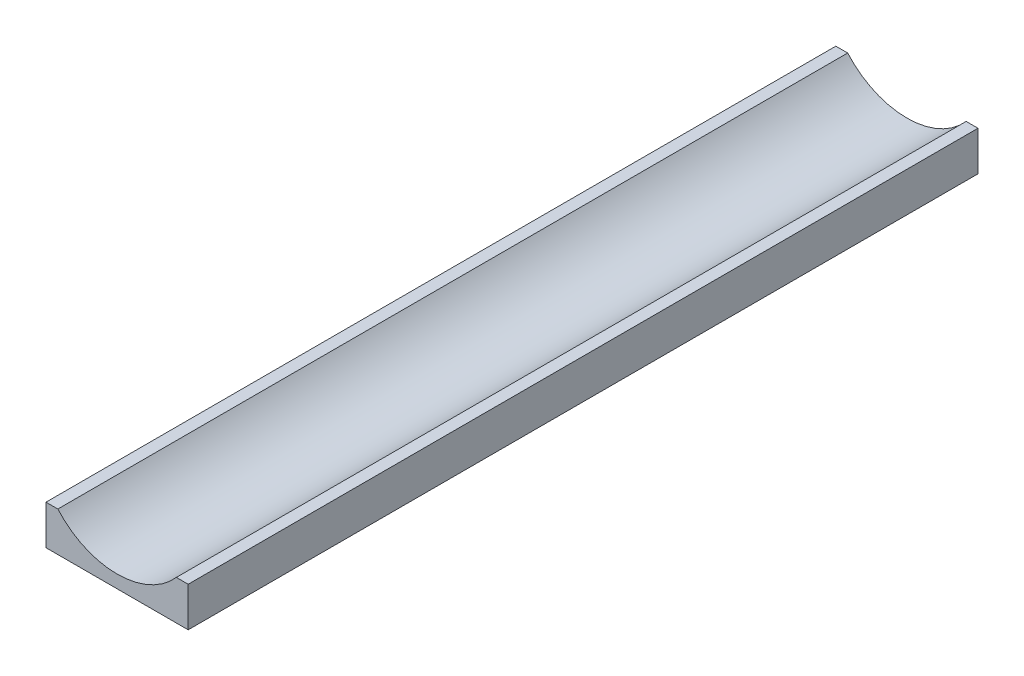
ISO-10303-21;
HEADER;
FILE_DESCRIPTION(('STEP AP214'),'2;1');
FILE_NAME('part.step','',(''),(''),'','','');
FILE_SCHEMA(('AUTOMOTIVE_DESIGN { 1 0 10303 214 1 1 1 1 }'));
ENDSEC;
DATA;
#1=APPLICATION_CONTEXT('core data for automotive mechanical design processes');
#2=APPLICATION_PROTOCOL_DEFINITION('international standard','automotive_design',2000,#1);
#3=PRODUCT_CONTEXT('',#1,'mechanical');
#4=PRODUCT('Part','Part','',(#3));
#5=PRODUCT_RELATED_PRODUCT_CATEGORY('part','',(#4));
#6=PRODUCT_DEFINITION_FORMATION('','',#4);
#7=PRODUCT_DEFINITION_CONTEXT('part definition',#1,'design');
#8=PRODUCT_DEFINITION('design','',#6,#7);
#9=PRODUCT_DEFINITION_SHAPE('','',#8);
#10=(LENGTH_UNIT() NAMED_UNIT(*) SI_UNIT(.MILLI.,.METRE.));
#11=(NAMED_UNIT(*) PLANE_ANGLE_UNIT() SI_UNIT($,.RADIAN.));
#12=(NAMED_UNIT(*) SI_UNIT($,.STERADIAN.) SOLID_ANGLE_UNIT());
#13=UNCERTAINTY_MEASURE_WITH_UNIT(LENGTH_MEASURE(1.E-05),#10,'distance_accuracy_value','');
#14=(GEOMETRIC_REPRESENTATION_CONTEXT(3) GLOBAL_UNCERTAINTY_ASSIGNED_CONTEXT((#13)) GLOBAL_UNIT_ASSIGNED_CONTEXT((#10,
#11,#12)) REPRESENTATION_CONTEXT('',''));
#15=CARTESIAN_POINT('',(0.,0.,0.));
#16=DIRECTION('',(0.,0.,1.));
#17=DIRECTION('',(1.,0.,0.));
#18=AXIS2_PLACEMENT_3D('',#15,#16,#17);
#19=CARTESIAN_POINT('',(0.,6.5,0.));
#20=DIRECTION('',(0.,-1.,0.));
#21=DIRECTION('',(0.,0.,-1.));
#22=AXIS2_PLACEMENT_3D('',#19,#20,#21);
#23=PLANE('',#22);
#24=DIRECTION('',(-1.,0.,0.));
#25=VECTOR('',#24,1.);
#26=CARTESIAN_POINT('',(-9.7,6.5,3.2));
#27=LINE('',#26,#25);
#28=CARTESIAN_POINT('',(9.7,6.5,3.2));
#29=VERTEX_POINT('',#28);
#30=CARTESIAN_POINT('',(-9.7,6.5,3.2));
#31=VERTEX_POINT('',#30);
#32=EDGE_CURVE('E58',#29,#31,#27,.T.);
#33=ORIENTED_EDGE('',*,*,#32,.F.);
#34=DIRECTION('',(0.,0.,1.));
#35=VECTOR('',#34,1.);
#36=CARTESIAN_POINT('',(9.7,6.5,3.2));
#37=LINE('',#36,#35);
#38=CARTESIAN_POINT('',(9.7,6.5,-3.2));
#39=VERTEX_POINT('',#38);
#40=EDGE_CURVE('E164',#39,#29,#37,.T.);
#41=ORIENTED_EDGE('',*,*,#40,.F.);
#42=DIRECTION('',(1.,0.,0.));
#43=VECTOR('',#42,1.);
#44=CARTESIAN_POINT('',(-9.7,6.5,-3.2));
#45=LINE('',#44,#43);
#46=CARTESIAN_POINT('',(-9.7,6.5,-3.2));
#47=VERTEX_POINT('',#46);
#48=EDGE_CURVE('E167',#47,#39,#45,.T.);
#49=ORIENTED_EDGE('',*,*,#48,.F.);
#50=DIRECTION('',(0.,0.,-1.));
#51=VECTOR('',#50,1.);
#52=CARTESIAN_POINT('',(-9.7,6.5,3.2));
#53=LINE('',#52,#51);
#54=EDGE_CURVE('E173',#31,#47,#53,.T.);
#55=ORIENTED_EDGE('',*,*,#54,.F.);
#56=EDGE_LOOP('',(#33,#41,#49,#55));
#57=FACE_BOUND('',#56,.T.);
#58=DIRECTION('',(0.,0.,1.));
#59=VECTOR('',#58,1.);
#60=CARTESIAN_POINT('',(3.2,6.5,-89.3));
#61=LINE('',#60,#59);
#62=CARTESIAN_POINT('',(3.2,6.5,-95.7));
#63=VERTEX_POINT('',#62);
#64=CARTESIAN_POINT('',(3.2,6.5,-89.3));
#65=VERTEX_POINT('',#64);
#66=EDGE_CURVE('E66',#63,#65,#61,.T.);
#67=ORIENTED_EDGE('',*,*,#66,.F.);
#68=DIRECTION('',(1.,0.,0.));
#69=VECTOR('',#68,1.);
#70=CARTESIAN_POINT('',(3.2,6.5,-95.7));
#71=LINE('',#70,#69);
#72=CARTESIAN_POINT('',(-3.2,6.5,-95.7));
#73=VERTEX_POINT('',#72);
#74=EDGE_CURVE('E192',#73,#63,#71,.T.);
#75=ORIENTED_EDGE('',*,*,#74,.F.);
#76=DIRECTION('',(0.,0.,-1.));
#77=VECTOR('',#76,1.);
#78=CARTESIAN_POINT('',(-3.2,6.5,-89.3));
#79=LINE('',#78,#77);
#80=CARTESIAN_POINT('',(-3.2,6.5,-89.3));
#81=VERTEX_POINT('',#80);
#82=EDGE_CURVE('E195',#81,#73,#79,.T.);
#83=ORIENTED_EDGE('',*,*,#82,.F.);
#84=DIRECTION('',(-1.,0.,0.));
#85=VECTOR('',#84,1.);
#86=CARTESIAN_POINT('',(3.2,6.5,-89.3));
#87=LINE('',#86,#85);
#88=EDGE_CURVE('E199',#65,#81,#87,.T.);
#89=ORIENTED_EDGE('',*,*,#88,.F.);
#90=EDGE_LOOP('',(#67,#75,#83,#89));
#91=FACE_BOUND('',#90,.T.);
#92=DIRECTION('',(0.,0.,-1.));
#93=VECTOR('',#92,1.);
#94=CARTESIAN_POINT('',(-18.,6.5,92.5));
#95=LINE('',#94,#93);
#96=CARTESIAN_POINT('',(-18.,6.5,100.));
#97=VERTEX_POINT('',#96);
#98=CARTESIAN_POINT('',(-18.,6.5,-100.));
#99=VERTEX_POINT('',#98);
#100=EDGE_CURVE('E221',#97,#99,#95,.T.);
#101=ORIENTED_EDGE('',*,*,#100,.T.);
#102=DIRECTION('',(-1.,0.,0.));
#103=VECTOR('',#102,1.);
#104=CARTESIAN_POINT('',(18.,6.5,-100.));
#105=LINE('',#104,#103);
#106=CARTESIAN_POINT('',(18.,6.5,-100.));
#107=VERTEX_POINT('',#106);
#108=EDGE_CURVE('E236',#107,#99,#105,.T.);
#109=ORIENTED_EDGE('',*,*,#108,.F.);
#110=DIRECTION('',(0.,0.,-1.));
#111=VECTOR('',#110,1.);
#112=CARTESIAN_POINT('',(18.,6.5,92.5));
#113=LINE('',#112,#111);
#114=CARTESIAN_POINT('',(18.,6.5,100.));
#115=VERTEX_POINT('',#114);
#116=EDGE_CURVE('E219',#115,#107,#113,.T.);
#117=ORIENTED_EDGE('',*,*,#116,.F.);
#118=DIRECTION('',(1.,0.,0.));
#119=VECTOR('',#118,1.);
#120=CARTESIAN_POINT('',(-18.,6.5,100.));
#121=LINE('',#120,#119);
#122=EDGE_CURVE('E51',#97,#115,#121,.T.);
#123=ORIENTED_EDGE('',*,*,#122,.F.);
#124=EDGE_LOOP('',(#101,#109,#117,#123));
#125=FACE_BOUND('',#124,.T.);
#126=ADVANCED_FACE('F44',(#57,#91,#125),#23,.T.);
#127=CARTESIAN_POINT('',(15.,16.5,0.));
#128=DIRECTION('',(0.,1.,0.));
#129=DIRECTION('',(0.,0.,-1.));
#130=AXIS2_PLACEMENT_3D('',#127,#128,#129);
#131=PLANE('',#130);
#132=DIRECTION('',(0.,0.,-1.));
#133=VECTOR('',#132,1.);
#134=CARTESIAN_POINT('',(15.,16.5,0.));
#135=LINE('',#134,#133);
#136=CARTESIAN_POINT('',(15.,16.5,100.));
#137=VERTEX_POINT('',#136);
#138=CARTESIAN_POINT('',(15.,16.5,-100.));
#139=VERTEX_POINT('',#138);
#140=EDGE_CURVE('E179',#137,#139,#135,.T.);
#141=ORIENTED_EDGE('',*,*,#140,.F.);
#142=DIRECTION('',(-1.,0.,0.));
#143=VECTOR('',#142,1.);
#144=CARTESIAN_POINT('',(18.,16.5,100.));
#145=LINE('',#144,#143);
#146=CARTESIAN_POINT('',(18.,16.5,100.));
#147=VERTEX_POINT('',#146);
#148=EDGE_CURVE('E248',#147,#137,#145,.T.);
#149=ORIENTED_EDGE('',*,*,#148,.F.);
#150=DIRECTION('',(0.,0.,1.));
#151=VECTOR('',#150,1.);
#152=CARTESIAN_POINT('',(18.,16.5,0.));
#153=LINE('',#152,#151);
#154=CARTESIAN_POINT('',(18.,16.5,-100.));
#155=VERTEX_POINT('',#154);
#156=EDGE_CURVE('E213',#147,#155,#153,.F.);
#157=ORIENTED_EDGE('',*,*,#156,.T.);
#158=DIRECTION('',(1.,0.,0.));
#159=VECTOR('',#158,1.);
#160=CARTESIAN_POINT('',(15.,16.5,-100.));
#161=LINE('',#160,#159);
#162=EDGE_CURVE('E223',#139,#155,#161,.T.);
#163=ORIENTED_EDGE('',*,*,#162,.F.);
#164=EDGE_LOOP('',(#141,#149,#157,#163));
#165=FACE_BOUND('',#164,.T.);
#166=ADVANCED_FACE('F267',(#165),#131,.T.);
#167=CARTESIAN_POINT('',(18.,-1.5,0.));
#168=DIRECTION('',(-1.,0.,0.));
#169=DIRECTION('',(0.,0.,1.));
#170=AXIS2_PLACEMENT_3D('',#167,#168,#169);
#171=PLANE('',#170);
#172=ORIENTED_EDGE('',*,*,#156,.F.);
#173=DIRECTION('',(0.,1.,0.));
#174=VECTOR('',#173,1.);
#175=CARTESIAN_POINT('',(18.,6.5,100.));
#176=LINE('',#175,#174);
#177=EDGE_CURVE('E251',#115,#147,#176,.T.);
#178=ORIENTED_EDGE('',*,*,#177,.F.);
#179=ORIENTED_EDGE('',*,*,#116,.T.);
#180=DIRECTION('',(0.,-1.,0.));
#181=VECTOR('',#180,1.);
#182=CARTESIAN_POINT('',(18.,16.5,-100.));
#183=LINE('',#182,#181);
#184=EDGE_CURVE('E239',#155,#107,#183,.T.);
#185=ORIENTED_EDGE('',*,*,#184,.F.);
#186=EDGE_LOOP('',(#172,#178,#179,#185));
#187=FACE_BOUND('',#186,.T.);
#188=ADVANCED_FACE('F262',(#187),#171,.F.);
#189=CARTESIAN_POINT('',(-15.,16.5,0.));
#190=DIRECTION('',(0.,1.,0.));
#191=DIRECTION('',(0.,0.,-1.));
#192=AXIS2_PLACEMENT_3D('',#189,#190,#191);
#193=PLANE('',#192);
#194=DIRECTION('',(0.,0.,1.));
#195=VECTOR('',#194,1.);
#196=CARTESIAN_POINT('',(-18.,16.5,0.));
#197=LINE('',#196,#195);
#198=CARTESIAN_POINT('',(-18.,16.5,100.));
#199=VERTEX_POINT('',#198);
#200=CARTESIAN_POINT('',(-18.,16.5,-100.));
#201=VERTEX_POINT('',#200);
#202=EDGE_CURVE('E215',#199,#201,#197,.F.);
#203=ORIENTED_EDGE('',*,*,#202,.F.);
#204=DIRECTION('',(-1.,0.,0.));
#205=VECTOR('',#204,1.);
#206=CARTESIAN_POINT('',(-15.,16.5,100.));
#207=LINE('',#206,#205);
#208=CARTESIAN_POINT('',(-15.,16.5,100.));
#209=VERTEX_POINT('',#208);
#210=EDGE_CURVE('E242',#209,#199,#207,.T.);
#211=ORIENTED_EDGE('',*,*,#210,.F.);
#212=DIRECTION('',(0.,0.,-1.));
#213=VECTOR('',#212,1.);
#214=CARTESIAN_POINT('',(-15.,16.5,0.));
#215=LINE('',#214,#213);
#216=CARTESIAN_POINT('',(-15.,16.5,-100.));
#217=VERTEX_POINT('',#216);
#218=EDGE_CURVE('E217',#209,#217,#215,.T.);
#219=ORIENTED_EDGE('',*,*,#218,.T.);
#220=DIRECTION('',(1.,0.,0.));
#221=VECTOR('',#220,1.);
#222=CARTESIAN_POINT('',(-18.,16.5,-100.));
#223=LINE('',#222,#221);
#224=EDGE_CURVE('E230',#201,#217,#223,.T.);
#225=ORIENTED_EDGE('',*,*,#224,.F.);
#226=EDGE_LOOP('',(#203,#211,#219,#225));
#227=FACE_BOUND('',#226,.T.);
#228=ADVANCED_FACE('F277',(#227),#193,.T.);
#229=CARTESIAN_POINT('',(-18.,-1.5,0.));
#230=DIRECTION('',(-1.,0.,0.));
#231=DIRECTION('',(0.,0.,1.));
#232=AXIS2_PLACEMENT_3D('',#229,#230,#231);
#233=PLANE('',#232);
#234=ORIENTED_EDGE('',*,*,#100,.F.);
#235=DIRECTION('',(0.,-1.,0.));
#236=VECTOR('',#235,1.);
#237=CARTESIAN_POINT('',(-18.,16.5,100.));
#238=LINE('',#237,#236);
#239=EDGE_CURVE('E11',#199,#97,#238,.T.);
#240=ORIENTED_EDGE('',*,*,#239,.F.);
#241=ORIENTED_EDGE('',*,*,#202,.T.);
#242=DIRECTION('',(0.,1.,0.));
#243=VECTOR('',#242,1.);
#244=CARTESIAN_POINT('',(-18.,6.5,-100.));
#245=LINE('',#244,#243);
#246=EDGE_CURVE('E233',#99,#201,#245,.T.);
#247=ORIENTED_EDGE('',*,*,#246,.F.);
#248=EDGE_LOOP('',(#234,#240,#241,#247));
#249=FACE_BOUND('',#248,.T.);
#250=ADVANCED_FACE('F280',(#249),#233,.T.);
#251=CARTESIAN_POINT('',(0.,29.7287565553229,-92.5));
#252=DIRECTION('',(0.,0.,1.));
#253=DIRECTION('',(1.,0.,0.));
#254=AXIS2_PLACEMENT_3D('',#251,#252,#253);
#255=CYLINDRICAL_SURFACE('',#254,19.9999999999999);
#256=ORIENTED_EDGE('',*,*,#218,.F.);
#257=CARTESIAN_POINT('',(0.,29.7287565553229,100.));
#258=DIRECTION('',(0.,0.,-1.));
#259=DIRECTION('',(1.,0.,0.));
#260=AXIS2_PLACEMENT_3D('',#257,#258,#259);
#261=CIRCLE('',#260,19.9999999999999);
#262=EDGE_CURVE('E245',#137,#209,#261,.T.);
#263=ORIENTED_EDGE('',*,*,#262,.F.);
#264=ORIENTED_EDGE('',*,*,#140,.T.);
#265=CARTESIAN_POINT('',(0.,29.7287565553229,-100.));
#266=DIRECTION('',(0.,0.,1.));
#267=DIRECTION('',(-1.,0.,0.));
#268=AXIS2_PLACEMENT_3D('',#265,#266,#267);
#269=CIRCLE('',#268,19.9999999999999);
#270=EDGE_CURVE('E227',#217,#139,#269,.T.);
#271=ORIENTED_EDGE('',*,*,#270,.F.);
#272=EDGE_LOOP('',(#256,#263,#264,#271));
#273=FACE_BOUND('',#272,.T.);
#274=ADVANCED_FACE('F273',(#273),#255,.F.);
#275=CARTESIAN_POINT('',(0.,29.7287565553229,-100.));
#276=DIRECTION('',(0.,0.,-1.));
#277=DIRECTION('',(-1.,0.,0.));
#278=AXIS2_PLACEMENT_3D('',#275,#276,#277);
#279=PLANE('',#278);
#280=ORIENTED_EDGE('',*,*,#184,.T.);
#281=ORIENTED_EDGE('',*,*,#108,.T.);
#282=ORIENTED_EDGE('',*,*,#246,.T.);
#283=ORIENTED_EDGE('',*,*,#224,.T.);
#284=ORIENTED_EDGE('',*,*,#270,.T.);
#285=ORIENTED_EDGE('',*,*,#162,.T.);
#286=EDGE_LOOP('',(#280,#281,#282,#283,#284,#285));
#287=FACE_BOUND('',#286,.T.);
#288=ADVANCED_FACE('F269',(#287),#279,.T.);
#289=CARTESIAN_POINT('',(0.,29.7287565553229,100.));
#290=DIRECTION('',(0.,0.,1.));
#291=DIRECTION('',(1.,0.,0.));
#292=AXIS2_PLACEMENT_3D('',#289,#290,#291);
#293=PLANE('',#292);
#294=ORIENTED_EDGE('',*,*,#239,.T.);
#295=ORIENTED_EDGE('',*,*,#122,.T.);
#296=ORIENTED_EDGE('',*,*,#177,.T.);
#297=ORIENTED_EDGE('',*,*,#148,.T.);
#298=ORIENTED_EDGE('',*,*,#262,.T.);
#299=ORIENTED_EDGE('',*,*,#210,.T.);
#300=EDGE_LOOP('',(#294,#295,#296,#297,#298,#299));
#301=FACE_BOUND('',#300,.T.);
#302=ADVANCED_FACE('F257',(#301),#293,.T.);
#303=CARTESIAN_POINT('',(3.2,8.5,-89.3));
#304=DIRECTION('',(1.,0.,0.));
#305=DIRECTION('',(0.,0.,-1.));
#306=AXIS2_PLACEMENT_3D('',#303,#304,#305);
#307=PLANE('',#306);
#308=ORIENTED_EDGE('',*,*,#66,.T.);
#309=DIRECTION('',(0.,-1.,0.));
#310=VECTOR('',#309,1.);
#311=CARTESIAN_POINT('',(3.2,8.5,-89.3));
#312=LINE('',#311,#310);
#313=CARTESIAN_POINT('',(3.2,8.5,-89.3));
#314=VERTEX_POINT('',#313);
#315=EDGE_CURVE('E183',#314,#65,#312,.T.);
#316=ORIENTED_EDGE('',*,*,#315,.F.);
#317=DIRECTION('',(0.,0.,1.));
#318=VECTOR('',#317,1.);
#319=CARTESIAN_POINT('',(3.2,8.5,-89.3));
#320=LINE('',#319,#318);
#321=CARTESIAN_POINT('',(3.2,8.5,-95.7));
#322=VERTEX_POINT('',#321);
#323=EDGE_CURVE('E196',#322,#314,#320,.T.);
#324=ORIENTED_EDGE('',*,*,#323,.F.);
#325=DIRECTION('',(0.,-1.,0.));
#326=VECTOR('',#325,1.);
#327=CARTESIAN_POINT('',(3.2,8.5,-95.7));
#328=LINE('',#327,#326);
#329=EDGE_CURVE('E190',#322,#63,#328,.T.);
#330=ORIENTED_EDGE('',*,*,#329,.T.);
#331=EDGE_LOOP('',(#308,#316,#324,#330));
#332=FACE_BOUND('',#331,.T.);
#333=ADVANCED_FACE('F283',(#332),#307,.F.);
#334=CARTESIAN_POINT('',(3.2,8.5,-95.7));
#335=DIRECTION('',(0.,0.,-1.));
#336=DIRECTION('',(-1.,0.,0.));
#337=AXIS2_PLACEMENT_3D('',#334,#335,#336);
#338=PLANE('',#337);
#339=ORIENTED_EDGE('',*,*,#74,.T.);
#340=ORIENTED_EDGE('',*,*,#329,.F.);
#341=DIRECTION('',(1.,0.,0.));
#342=VECTOR('',#341,1.);
#343=CARTESIAN_POINT('',(3.2,8.5,-95.7));
#344=LINE('',#343,#342);
#345=CARTESIAN_POINT('',(-3.2,8.5,-95.7));
#346=VERTEX_POINT('',#345);
#347=EDGE_CURVE('E185',#346,#322,#344,.T.);
#348=ORIENTED_EDGE('',*,*,#347,.F.);
#349=DIRECTION('',(0.,-1.,0.));
#350=VECTOR('',#349,1.);
#351=CARTESIAN_POINT('',(-3.2,8.5,-95.7));
#352=LINE('',#351,#350);
#353=EDGE_CURVE('E188',#346,#73,#352,.T.);
#354=ORIENTED_EDGE('',*,*,#353,.T.);
#355=EDGE_LOOP('',(#339,#340,#348,#354));
#356=FACE_BOUND('',#355,.T.);
#357=ADVANCED_FACE('F292',(#356),#338,.F.);
#358=CARTESIAN_POINT('',(-3.2,8.5,-89.3));
#359=DIRECTION('',(-1.,0.,0.));
#360=DIRECTION('',(0.,0.,1.));
#361=AXIS2_PLACEMENT_3D('',#358,#359,#360);
#362=PLANE('',#361);
#363=ORIENTED_EDGE('',*,*,#82,.T.);
#364=ORIENTED_EDGE('',*,*,#353,.F.);
#365=DIRECTION('',(0.,0.,-1.));
#366=VECTOR('',#365,1.);
#367=CARTESIAN_POINT('',(-3.2,8.5,-89.3));
#368=LINE('',#367,#366);
#369=CARTESIAN_POINT('',(-3.2,8.5,-89.3));
#370=VERTEX_POINT('',#369);
#371=EDGE_CURVE('E205',#370,#346,#368,.T.);
#372=ORIENTED_EDGE('',*,*,#371,.F.);
#373=DIRECTION('',(0.,-1.,0.));
#374=VECTOR('',#373,1.);
#375=CARTESIAN_POINT('',(-3.2,8.5,-89.3));
#376=LINE('',#375,#374);
#377=EDGE_CURVE('E186',#370,#81,#376,.T.);
#378=ORIENTED_EDGE('',*,*,#377,.T.);
#379=EDGE_LOOP('',(#363,#364,#372,#378));
#380=FACE_BOUND('',#379,.T.);
#381=ADVANCED_FACE('F316',(#380),#362,.F.);
#382=CARTESIAN_POINT('',(3.2,8.5,-89.3));
#383=DIRECTION('',(0.,0.,1.));
#384=DIRECTION('',(1.,0.,0.));
#385=AXIS2_PLACEMENT_3D('',#382,#383,#384);
#386=PLANE('',#385);
#387=ORIENTED_EDGE('',*,*,#88,.T.);
#388=ORIENTED_EDGE('',*,*,#377,.F.);
#389=DIRECTION('',(-1.,0.,0.));
#390=VECTOR('',#389,1.);
#391=CARTESIAN_POINT('',(3.2,8.5,-89.3));
#392=LINE('',#391,#390);
#393=EDGE_CURVE('E208',#314,#370,#392,.T.);
#394=ORIENTED_EDGE('',*,*,#393,.F.);
#395=ORIENTED_EDGE('',*,*,#315,.T.);
#396=EDGE_LOOP('',(#387,#388,#394,#395));
#397=FACE_BOUND('',#396,.T.);
#398=ADVANCED_FACE('F312',(#397),#386,.F.);
#399=CARTESIAN_POINT('',(0.,8.5,0.));
#400=DIRECTION('',(0.,1.,0.));
#401=DIRECTION('',(0.,0.,1.));
#402=AXIS2_PLACEMENT_3D('',#399,#400,#401);
#403=PLANE('',#402);
#404=ORIENTED_EDGE('',*,*,#323,.T.);
#405=ORIENTED_EDGE('',*,*,#393,.T.);
#406=ORIENTED_EDGE('',*,*,#371,.T.);
#407=ORIENTED_EDGE('',*,*,#347,.T.);
#408=EDGE_LOOP('',(#404,#405,#406,#407));
#409=FACE_BOUND('',#408,.T.);
#410=ADVANCED_FACE('F309',(#409),#403,.F.);
#411=CARTESIAN_POINT('',(-9.7,8.5,3.2));
#412=DIRECTION('',(0.,0.,1.));
#413=DIRECTION('',(1.,0.,0.));
#414=AXIS2_PLACEMENT_3D('',#411,#412,#413);
#415=PLANE('',#414);
#416=ORIENTED_EDGE('',*,*,#32,.T.);
#417=DIRECTION('',(0.,-1.,0.));
#418=VECTOR('',#417,1.);
#419=CARTESIAN_POINT('',(-9.7,8.5,3.2));
#420=LINE('',#419,#418);
#421=CARTESIAN_POINT('',(-9.7,8.5,3.2));
#422=VERTEX_POINT('',#421);
#423=EDGE_CURVE('E142',#422,#31,#420,.T.);
#424=ORIENTED_EDGE('',*,*,#423,.F.);
#425=DIRECTION('',(-1.,0.,0.));
#426=VECTOR('',#425,1.);
#427=CARTESIAN_POINT('',(-9.7,8.5,3.2));
#428=LINE('',#427,#426);
#429=CARTESIAN_POINT('',(9.7,8.5,3.2));
#430=VERTEX_POINT('',#429);
#431=EDGE_CURVE('E146',#430,#422,#428,.T.);
#432=ORIENTED_EDGE('',*,*,#431,.F.);
#433=DIRECTION('',(0.,-1.,0.));
#434=VECTOR('',#433,1.);
#435=CARTESIAN_POINT('',(9.7,8.5,3.2));
#436=LINE('',#435,#434);
#437=EDGE_CURVE('E177',#430,#29,#436,.T.);
#438=ORIENTED_EDGE('',*,*,#437,.T.);
#439=EDGE_LOOP('',(#416,#424,#432,#438));
#440=FACE_BOUND('',#439,.T.);
#441=ADVANCED_FACE('F144',(#440),#415,.F.);
#442=CARTESIAN_POINT('',(9.7,8.5,3.2));
#443=DIRECTION('',(1.,0.,0.));
#444=DIRECTION('',(0.,0.,-1.));
#445=AXIS2_PLACEMENT_3D('',#442,#443,#444);
#446=PLANE('',#445);
#447=ORIENTED_EDGE('',*,*,#40,.T.);
#448=ORIENTED_EDGE('',*,*,#437,.F.);
#449=DIRECTION('',(0.,0.,1.));
#450=VECTOR('',#449,1.);
#451=CARTESIAN_POINT('',(9.7,8.5,3.2));
#452=LINE('',#451,#450);
#453=CARTESIAN_POINT('',(9.7,8.5,-3.2));
#454=VERTEX_POINT('',#453);
#455=EDGE_CURVE('E152',#454,#430,#452,.T.);
#456=ORIENTED_EDGE('',*,*,#455,.F.);
#457=DIRECTION('',(0.,-1.,0.));
#458=VECTOR('',#457,1.);
#459=CARTESIAN_POINT('',(9.7,8.5,-3.2));
#460=LINE('',#459,#458);
#461=EDGE_CURVE('E180',#454,#39,#460,.T.);
#462=ORIENTED_EDGE('',*,*,#461,.T.);
#463=EDGE_LOOP('',(#447,#448,#456,#462));
#464=FACE_BOUND('',#463,.T.);
#465=ADVANCED_FACE('F326',(#464),#446,.F.);
#466=CARTESIAN_POINT('',(-9.7,8.5,-3.2));
#467=DIRECTION('',(0.,0.,-1.));
#468=DIRECTION('',(-1.,0.,0.));
#469=AXIS2_PLACEMENT_3D('',#466,#467,#468);
#470=PLANE('',#469);
#471=ORIENTED_EDGE('',*,*,#48,.T.);
#472=ORIENTED_EDGE('',*,*,#461,.F.);
#473=DIRECTION('',(1.,0.,0.));
#474=VECTOR('',#473,1.);
#475=CARTESIAN_POINT('',(-9.7,8.5,-3.2));
#476=LINE('',#475,#474);
#477=CARTESIAN_POINT('',(-9.7,8.5,-3.2));
#478=VERTEX_POINT('',#477);
#479=EDGE_CURVE('E160',#478,#454,#476,.T.);
#480=ORIENTED_EDGE('',*,*,#479,.F.);
#481=DIRECTION('',(0.,-1.,0.));
#482=VECTOR('',#481,1.);
#483=CARTESIAN_POINT('',(-9.7,8.5,-3.2));
#484=LINE('',#483,#482);
#485=EDGE_CURVE('E151',#478,#47,#484,.T.);
#486=ORIENTED_EDGE('',*,*,#485,.T.);
#487=EDGE_LOOP('',(#471,#472,#480,#486));
#488=FACE_BOUND('',#487,.T.);
#489=ADVANCED_FACE('F329',(#488),#470,.F.);
#490=CARTESIAN_POINT('',(-9.7,8.5,3.2));
#491=DIRECTION('',(-1.,0.,0.));
#492=DIRECTION('',(0.,0.,1.));
#493=AXIS2_PLACEMENT_3D('',#490,#491,#492);
#494=PLANE('',#493);
#495=ORIENTED_EDGE('',*,*,#54,.T.);
#496=ORIENTED_EDGE('',*,*,#485,.F.);
#497=DIRECTION('',(0.,0.,-1.));
#498=VECTOR('',#497,1.);
#499=CARTESIAN_POINT('',(-9.7,8.5,3.2));
#500=LINE('',#499,#498);
#501=EDGE_CURVE('E155',#422,#478,#500,.T.);
#502=ORIENTED_EDGE('',*,*,#501,.F.);
#503=ORIENTED_EDGE('',*,*,#423,.T.);
#504=EDGE_LOOP('',(#495,#496,#502,#503));
#505=FACE_BOUND('',#504,.T.);
#506=ADVANCED_FACE('F156',(#505),#494,.F.);
#507=CARTESIAN_POINT('',(0.,8.5,0.));
#508=DIRECTION('',(0.,1.,0.));
#509=DIRECTION('',(0.,0.,1.));
#510=AXIS2_PLACEMENT_3D('',#507,#508,#509);
#511=PLANE('',#510);
#512=ORIENTED_EDGE('',*,*,#431,.T.);
#513=ORIENTED_EDGE('',*,*,#501,.T.);
#514=ORIENTED_EDGE('',*,*,#479,.T.);
#515=ORIENTED_EDGE('',*,*,#455,.T.);
#516=EDGE_LOOP('',(#512,#513,#514,#515));
#517=FACE_BOUND('',#516,.T.);
#518=ADVANCED_FACE('F162',(#517),#511,.F.);
#519=CLOSED_SHELL('',(#126,#166,#188,#228,#250,#274,#288,#302,#333,#357,#381,#398,#410,#441,
#465,#489,#506,#518));
#520=MANIFOLD_SOLID_BREP('B2',#519);
#521=ADVANCED_BREP_SHAPE_REPRESENTATION('',(#18,#520),#14);
#522=SHAPE_DEFINITION_REPRESENTATION(#9,#521);
ENDSEC;
END-ISO-10303-21;
